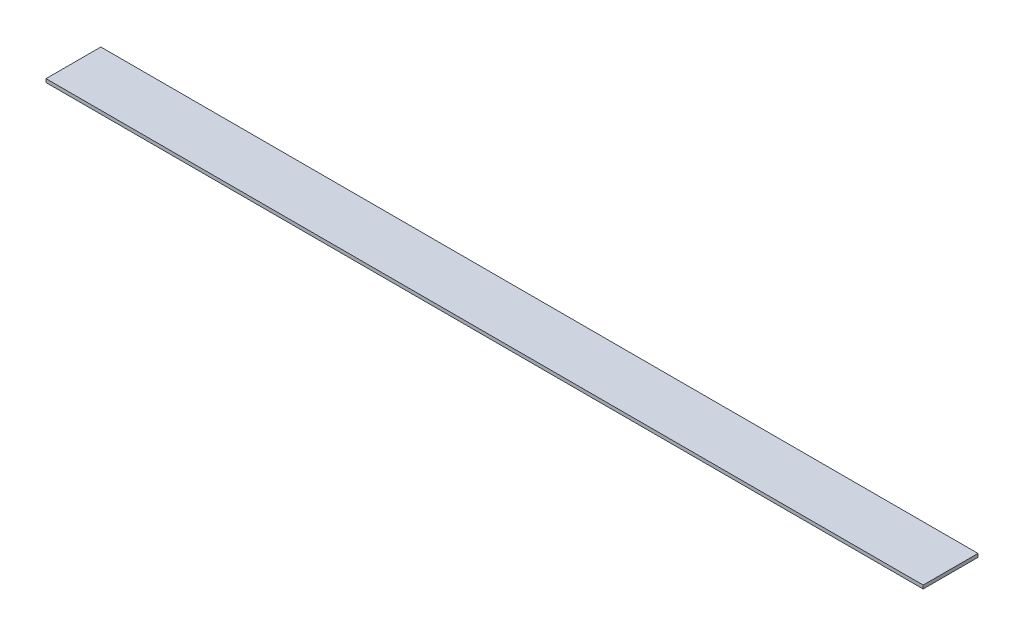
ISO-10303-21;
HEADER;
FILE_DESCRIPTION(('STEP AP214'),'2;1');
FILE_NAME('part.step','',(''),(''),'','','');
FILE_SCHEMA(('AUTOMOTIVE_DESIGN { 1 0 10303 214 1 1 1 1 }'));
ENDSEC;
DATA;
#1=APPLICATION_CONTEXT('core data for automotive mechanical design processes');
#2=APPLICATION_PROTOCOL_DEFINITION('international standard','automotive_design',2000,#1);
#3=PRODUCT_CONTEXT('',#1,'mechanical');
#4=PRODUCT('Part','Part','',(#3));
#5=PRODUCT_RELATED_PRODUCT_CATEGORY('part','',(#4));
#6=PRODUCT_DEFINITION_FORMATION('','',#4);
#7=PRODUCT_DEFINITION_CONTEXT('part definition',#1,'design');
#8=PRODUCT_DEFINITION('design','',#6,#7);
#9=PRODUCT_DEFINITION_SHAPE('','',#8);
#10=(LENGTH_UNIT() NAMED_UNIT(*) SI_UNIT(.MILLI.,.METRE.));
#11=(NAMED_UNIT(*) PLANE_ANGLE_UNIT() SI_UNIT($,.RADIAN.));
#12=(NAMED_UNIT(*) SI_UNIT($,.STERADIAN.) SOLID_ANGLE_UNIT());
#13=UNCERTAINTY_MEASURE_WITH_UNIT(LENGTH_MEASURE(1.E-05),#10,'distance_accuracy_value','');
#14=(GEOMETRIC_REPRESENTATION_CONTEXT(3) GLOBAL_UNCERTAINTY_ASSIGNED_CONTEXT((#13)) GLOBAL_UNIT_ASSIGNED_CONTEXT((#10,
#11,#12)) REPRESENTATION_CONTEXT('',''));
#15=CARTESIAN_POINT('',(0.,0.,0.));
#16=DIRECTION('',(0.,0.,1.));
#17=DIRECTION('',(1.,0.,0.));
#18=AXIS2_PLACEMENT_3D('',#15,#16,#17);
#19=CARTESIAN_POINT('',(0.,1.5875,0.));
#20=DIRECTION('',(1.,0.,0.));
#21=DIRECTION('',(0.,0.,-1.));
#22=AXIS2_PLACEMENT_3D('',#19,#20,#21);
#23=PLANE('',#22);
#24=DIRECTION('',(0.,0.,1.));
#25=VECTOR('',#24,1.);
#26=CARTESIAN_POINT('',(0.,0.,0.));
#27=LINE('',#26,#25);
#28=CARTESIAN_POINT('',(0.,0.,-25.4));
#29=VERTEX_POINT('',#28);
#30=CARTESIAN_POINT('',(0.,0.,0.));
#31=VERTEX_POINT('',#30);
#32=EDGE_CURVE('E95',#29,#31,#27,.T.);
#33=ORIENTED_EDGE('',*,*,#32,.T.);
#34=DIRECTION('',(0.,-1.,0.));
#35=VECTOR('',#34,1.);
#36=CARTESIAN_POINT('',(0.,1.5875,0.));
#37=LINE('',#36,#35);
#38=CARTESIAN_POINT('',(0.,1.5875,0.));
#39=VERTEX_POINT('',#38);
#40=EDGE_CURVE('E11',#39,#31,#37,.T.);
#41=ORIENTED_EDGE('',*,*,#40,.F.);
#42=DIRECTION('',(0.,0.,1.));
#43=VECTOR('',#42,1.);
#44=CARTESIAN_POINT('',(0.,1.5875,0.));
#45=LINE('',#44,#43);
#46=CARTESIAN_POINT('',(0.,1.5875,-25.4));
#47=VERTEX_POINT('',#46);
#48=EDGE_CURVE('E83',#47,#39,#45,.T.);
#49=ORIENTED_EDGE('',*,*,#48,.F.);
#50=DIRECTION('',(0.,-1.,0.));
#51=VECTOR('',#50,1.);
#52=CARTESIAN_POINT('',(0.,1.5875,-25.4));
#53=LINE('',#52,#51);
#54=EDGE_CURVE('E91',#47,#29,#53,.T.);
#55=ORIENTED_EDGE('',*,*,#54,.T.);
#56=EDGE_LOOP('',(#33,#41,#49,#55));
#57=FACE_BOUND('',#56,.T.);
#58=ADVANCED_FACE('F32',(#57),#23,.F.);
#59=CARTESIAN_POINT('',(0.,1.5875,0.));
#60=DIRECTION('',(0.,0.,-1.));
#61=DIRECTION('',(-1.,0.,0.));
#62=AXIS2_PLACEMENT_3D('',#59,#60,#61);
#63=PLANE('',#62);
#64=DIRECTION('',(1.,0.,0.));
#65=VECTOR('',#64,1.);
#66=CARTESIAN_POINT('',(0.,0.,0.));
#67=LINE('',#66,#65);
#68=CARTESIAN_POINT('',(406.4,0.,0.));
#69=VERTEX_POINT('',#68);
#70=EDGE_CURVE('E87',#31,#69,#67,.T.);
#71=ORIENTED_EDGE('',*,*,#70,.T.);
#72=DIRECTION('',(0.,-1.,0.));
#73=VECTOR('',#72,1.);
#74=CARTESIAN_POINT('',(406.4,1.5875,0.));
#75=LINE('',#74,#73);
#76=CARTESIAN_POINT('',(406.4,1.5875,0.));
#77=VERTEX_POINT('',#76);
#78=EDGE_CURVE('E40',#77,#69,#75,.T.);
#79=ORIENTED_EDGE('',*,*,#78,.F.);
#80=DIRECTION('',(1.,0.,0.));
#81=VECTOR('',#80,1.);
#82=CARTESIAN_POINT('',(0.,1.5875,0.));
#83=LINE('',#82,#81);
#84=EDGE_CURVE('E78',#39,#77,#83,.T.);
#85=ORIENTED_EDGE('',*,*,#84,.F.);
#86=ORIENTED_EDGE('',*,*,#40,.T.);
#87=EDGE_LOOP('',(#71,#79,#85,#86));
#88=FACE_BOUND('',#87,.T.);
#89=ADVANCED_FACE('F86',(#88),#63,.F.);
#90=CARTESIAN_POINT('',(406.4,1.5875,0.));
#91=DIRECTION('',(-1.,0.,0.));
#92=DIRECTION('',(0.,0.,1.));
#93=AXIS2_PLACEMENT_3D('',#90,#91,#92);
#94=PLANE('',#93);
#95=DIRECTION('',(0.,0.,-1.));
#96=VECTOR('',#95,1.);
#97=CARTESIAN_POINT('',(406.4,0.,0.));
#98=LINE('',#97,#96);
#99=CARTESIAN_POINT('',(406.4,0.,-25.4));
#100=VERTEX_POINT('',#99);
#101=EDGE_CURVE('E65',#69,#100,#98,.T.);
#102=ORIENTED_EDGE('',*,*,#101,.T.);
#103=DIRECTION('',(0.,-1.,0.));
#104=VECTOR('',#103,1.);
#105=CARTESIAN_POINT('',(406.4,1.5875,-25.4));
#106=LINE('',#105,#104);
#107=CARTESIAN_POINT('',(406.4,1.5875,-25.4));
#108=VERTEX_POINT('',#107);
#109=EDGE_CURVE('E88',#108,#100,#106,.T.);
#110=ORIENTED_EDGE('',*,*,#109,.F.);
#111=DIRECTION('',(0.,0.,-1.));
#112=VECTOR('',#111,1.);
#113=CARTESIAN_POINT('',(406.4,1.5875,0.));
#114=LINE('',#113,#112);
#115=EDGE_CURVE('E81',#77,#108,#114,.T.);
#116=ORIENTED_EDGE('',*,*,#115,.F.);
#117=ORIENTED_EDGE('',*,*,#78,.T.);
#118=EDGE_LOOP('',(#102,#110,#116,#117));
#119=FACE_BOUND('',#118,.T.);
#120=ADVANCED_FACE('F89',(#119),#94,.F.);
#121=CARTESIAN_POINT('',(0.,1.5875,-25.4));
#122=DIRECTION('',(0.,0.,1.));
#123=DIRECTION('',(1.,0.,0.));
#124=AXIS2_PLACEMENT_3D('',#121,#122,#123);
#125=PLANE('',#124);
#126=DIRECTION('',(-1.,0.,0.));
#127=VECTOR('',#126,1.);
#128=CARTESIAN_POINT('',(0.,0.,-25.4));
#129=LINE('',#128,#127);
#130=EDGE_CURVE('E71',#100,#29,#129,.T.);
#131=ORIENTED_EDGE('',*,*,#130,.T.);
#132=ORIENTED_EDGE('',*,*,#54,.F.);
#133=DIRECTION('',(-1.,0.,0.));
#134=VECTOR('',#133,1.);
#135=CARTESIAN_POINT('',(0.,1.5875,-25.4));
#136=LINE('',#135,#134);
#137=EDGE_CURVE('E48',#108,#47,#136,.T.);
#138=ORIENTED_EDGE('',*,*,#137,.F.);
#139=ORIENTED_EDGE('',*,*,#109,.T.);
#140=EDGE_LOOP('',(#131,#132,#138,#139));
#141=FACE_BOUND('',#140,.T.);
#142=ADVANCED_FACE('F102',(#141),#125,.F.);
#143=CARTESIAN_POINT('',(0.,1.5875,0.));
#144=DIRECTION('',(0.,-1.,0.));
#145=DIRECTION('',(0.,0.,-1.));
#146=AXIS2_PLACEMENT_3D('',#143,#144,#145);
#147=PLANE('',#146);
#148=ORIENTED_EDGE('',*,*,#48,.T.);
#149=ORIENTED_EDGE('',*,*,#84,.T.);
#150=ORIENTED_EDGE('',*,*,#115,.T.);
#151=ORIENTED_EDGE('',*,*,#137,.T.);
#152=EDGE_LOOP('',(#148,#149,#150,#151));
#153=FACE_BOUND('',#152,.T.);
#154=ADVANCED_FACE('F79',(#153),#147,.F.);
#155=CARTESIAN_POINT('',(0.,0.,0.));
#156=DIRECTION('',(0.,-1.,0.));
#157=DIRECTION('',(0.,0.,-1.));
#158=AXIS2_PLACEMENT_3D('',#155,#156,#157);
#159=PLANE('',#158);
#160=ORIENTED_EDGE('',*,*,#32,.F.);
#161=ORIENTED_EDGE('',*,*,#130,.F.);
#162=ORIENTED_EDGE('',*,*,#101,.F.);
#163=ORIENTED_EDGE('',*,*,#70,.F.);
#164=EDGE_LOOP('',(#160,#161,#162,#163));
#165=FACE_BOUND('',#164,.T.);
#166=ADVANCED_FACE('F105',(#165),#159,.T.);
#167=CLOSED_SHELL('',(#58,#89,#120,#142,#154,#166));
#168=MANIFOLD_SOLID_BREP('B2',#167);
#169=ADVANCED_BREP_SHAPE_REPRESENTATION('',(#18,#168),#14);
#170=SHAPE_DEFINITION_REPRESENTATION(#9,#169);
ENDSEC;
END-ISO-10303-21;
